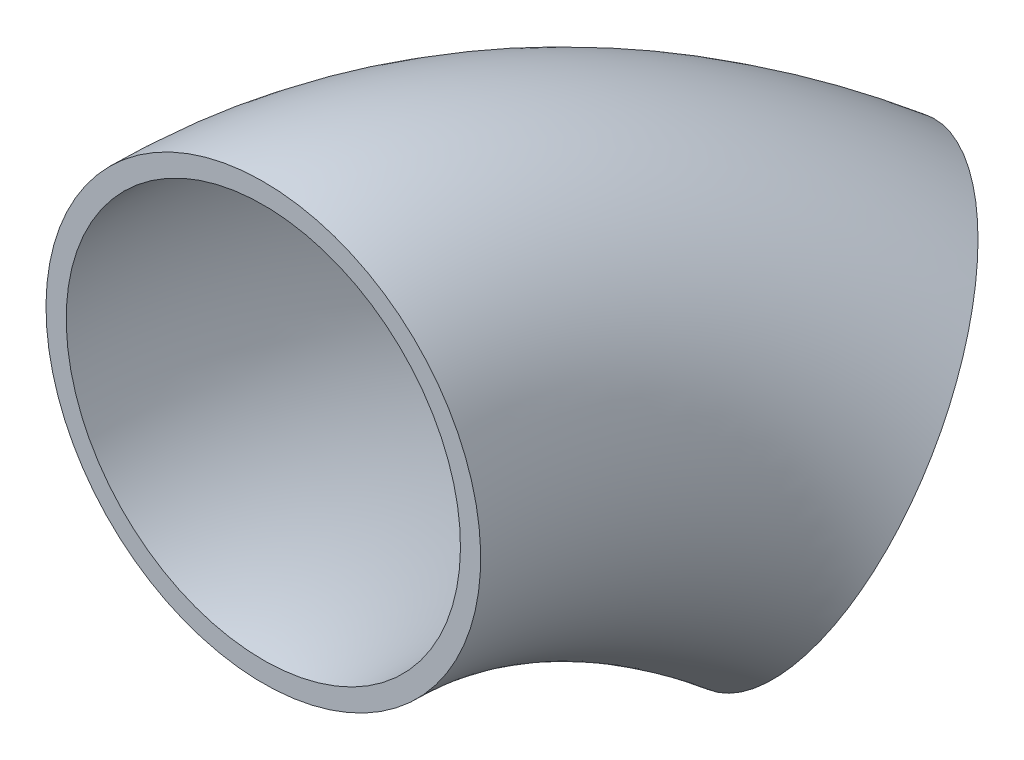
ISO-10303-21;
HEADER;
FILE_DESCRIPTION(('STEP AP214'),'2;1');
FILE_NAME('part.step','',(''),(''),'','','');
FILE_SCHEMA(('AUTOMOTIVE_DESIGN { 1 0 10303 214 1 1 1 1 }'));
ENDSEC;
DATA;
#1=APPLICATION_CONTEXT('core data for automotive mechanical design processes');
#2=APPLICATION_PROTOCOL_DEFINITION('international standard','automotive_design',2000,#1);
#3=PRODUCT_CONTEXT('',#1,'mechanical');
#4=PRODUCT('Part','Part','',(#3));
#5=PRODUCT_RELATED_PRODUCT_CATEGORY('part','',(#4));
#6=PRODUCT_DEFINITION_FORMATION('','',#4);
#7=PRODUCT_DEFINITION_CONTEXT('part definition',#1,'design');
#8=PRODUCT_DEFINITION('design','',#6,#7);
#9=PRODUCT_DEFINITION_SHAPE('','',#8);
#10=(LENGTH_UNIT() NAMED_UNIT(*) SI_UNIT(.MILLI.,.METRE.));
#11=(NAMED_UNIT(*) PLANE_ANGLE_UNIT() SI_UNIT($,.RADIAN.));
#12=(NAMED_UNIT(*) SI_UNIT($,.STERADIAN.) SOLID_ANGLE_UNIT());
#13=UNCERTAINTY_MEASURE_WITH_UNIT(LENGTH_MEASURE(1.E-05),#10,'distance_accuracy_value','');
#14=(GEOMETRIC_REPRESENTATION_CONTEXT(3) GLOBAL_UNCERTAINTY_ASSIGNED_CONTEXT((#13)) GLOBAL_UNIT_ASSIGNED_CONTEXT((#10,
#11,#12)) REPRESENTATION_CONTEXT('',''));
#15=CARTESIAN_POINT('',(0.,0.,0.));
#16=DIRECTION('',(0.,0.,1.));
#17=DIRECTION('',(1.,0.,0.));
#18=AXIS2_PLACEMENT_3D('',#15,#16,#17);
#19=CARTESIAN_POINT('',(269.407683632075,-269.407683632075,-1.77635683940025E-12));
#20=DIRECTION('',(0.707106781186548,0.707106781186547,0.));
#21=DIRECTION('',(-0.707106781186548,0.707106781186547,0.));
#22=AXIS2_PLACEMENT_3D('',#19,#20,#21);
#23=TOROIDAL_SURFACE('',#22,381.,123.825);
#24=CARTESIAN_POINT('',(78.9076836320746,-78.9076836320728,-269.407683632073));
#25=DIRECTION('',(-0.499999999999995,0.499999999999995,0.707106781186554));
#26=DIRECTION('',(0.853553390593277,0.146446609406723,0.499999999999995));
#27=AXIS2_PLACEMENT_3D('',#24,#25,#26);
#28=CIRCLE('',#27,123.825);
#29=CARTESIAN_POINT('',(16.9951836320735,-16.9951836320711,-356.965180812497));
#30=VERTEX_POINT('',#29);
#31=EDGE_CURVE('E32',#30,#30,#28,.T.);
#32=CARTESIAN_POINT('',(0.,0.,-3.5527136788005E-12));
#33=DIRECTION('',(0.,0.,1.));
#34=DIRECTION('',(1.,0.,0.));
#35=AXIS2_PLACEMENT_3D('',#32,#33,#34);
#36=CIRCLE('',#35,123.825);
#37=CARTESIAN_POINT('',(-87.5574971804242,87.5574971804242,-4.13002965160558E-12));
#38=VERTEX_POINT('',#37);
#39=EDGE_CURVE('E40',#38,#38,#36,.T.);
#40=CARTESIAN_POINT('',(269.407683632075,-269.407683632075,-1.77635683940025E-12));
#41=DIRECTION('',(0.707106781186548,0.707106781186547,0.));
#42=DIRECTION('',(-0.707106781186548,0.707106781186547,0.));
#43=AXIS2_PLACEMENT_3D('',#40,#41,#42);
#44=CIRCLE('',#43,504.825);
#45=EDGE_CURVE('',#30,#38,#44,.T.);
#46=ORIENTED_EDGE('',*,*,#31,.F.);
#47=ORIENTED_EDGE('',*,*,#39,.T.);
#48=ORIENTED_EDGE('',*,*,#45,.T.);
#49=ORIENTED_EDGE('',*,*,#45,.F.);
#50=EDGE_LOOP('',(#46,#48,#47,#49));
#51=FACE_BOUND('',#50,.T.);
#52=ADVANCED_FACE('F25',(#51),#23,.F.);
#53=CARTESIAN_POINT('',(269.407683632075,-269.407683632075,-1.77635683940025E-12));
#54=DIRECTION('',(0.707106781186548,0.707106781186547,0.));
#55=DIRECTION('',(-0.707106781186548,0.707106781186547,0.));
#56=AXIS2_PLACEMENT_3D('',#53,#54,#55);
#57=TOROIDAL_SURFACE('',#56,381.,136.525);
#58=CARTESIAN_POINT('',(78.9076836320746,-78.9076836320728,-269.407683632073));
#59=DIRECTION('',(-0.499999999999995,0.499999999999995,0.707106781186554));
#60=DIRECTION('',(0.853553390593277,0.146446609406723,0.499999999999995));
#61=AXIS2_PLACEMENT_3D('',#58,#59,#60);
#62=CIRCLE('',#61,136.525);
#63=CARTESIAN_POINT('',(10.6451836320735,-10.6451836320711,-365.945436933567));
#64=VERTEX_POINT('',#63);
#65=EDGE_CURVE('E10',#64,#64,#62,.T.);
#66=CARTESIAN_POINT('',(0.,0.,-3.5527136788005E-12));
#67=DIRECTION('',(0.,0.,1.));
#68=DIRECTION('',(1.,0.,0.));
#69=AXIS2_PLACEMENT_3D('',#66,#67,#68);
#70=CIRCLE('',#69,136.525);
#71=CARTESIAN_POINT('',(-96.5377533014934,96.5377533014934,-4.18924154625226E-12));
#72=VERTEX_POINT('',#71);
#73=EDGE_CURVE('E36',#72,#72,#70,.T.);
#74=CARTESIAN_POINT('',(269.407683632075,-269.407683632075,-1.77635683940025E-12));
#75=DIRECTION('',(0.707106781186548,0.707106781186547,0.));
#76=DIRECTION('',(-0.707106781186548,0.707106781186547,0.));
#77=AXIS2_PLACEMENT_3D('',#74,#75,#76);
#78=CIRCLE('',#77,517.525);
#79=EDGE_CURVE('',#64,#72,#78,.T.);
#80=ORIENTED_EDGE('',*,*,#65,.T.);
#81=ORIENTED_EDGE('',*,*,#73,.F.);
#82=ORIENTED_EDGE('',*,*,#79,.T.);
#83=ORIENTED_EDGE('',*,*,#79,.F.);
#84=EDGE_LOOP('',(#80,#82,#81,#83));
#85=FACE_BOUND('',#84,.T.);
#86=ADVANCED_FACE('F27',(#85),#57,.T.);
#87=CARTESIAN_POINT('',(78.9076836320746,-78.9076836320728,-269.407683632073));
#88=DIRECTION('',(-0.499999999999995,0.499999999999995,0.707106781186554));
#89=DIRECTION('',(0.853553390593277,0.146446609406723,0.499999999999995));
#90=AXIS2_PLACEMENT_3D('',#87,#88,#89);
#91=PLANE('',#90);
#92=ORIENTED_EDGE('',*,*,#31,.T.);
#93=EDGE_LOOP('',(#92));
#94=FACE_BOUND('',#93,.T.);
#95=ORIENTED_EDGE('',*,*,#65,.F.);
#96=EDGE_LOOP('',(#95));
#97=FACE_BOUND('',#96,.T.);
#98=ADVANCED_FACE('F50',(#94,#97),#91,.F.);
#99=CARTESIAN_POINT('',(0.,0.,-3.5527136788005E-12));
#100=DIRECTION('',(0.,0.,1.));
#101=DIRECTION('',(1.,0.,0.));
#102=AXIS2_PLACEMENT_3D('',#99,#100,#101);
#103=PLANE('',#102);
#104=ORIENTED_EDGE('',*,*,#39,.F.);
#105=EDGE_LOOP('',(#104));
#106=FACE_BOUND('',#105,.T.);
#107=ORIENTED_EDGE('',*,*,#73,.T.);
#108=EDGE_LOOP('',(#107));
#109=FACE_BOUND('',#108,.T.);
#110=ADVANCED_FACE('F47',(#106,#109),#103,.T.);
#111=CLOSED_SHELL('',(#52,#86,#98,#110));
#112=MANIFOLD_SOLID_BREP('B2',#111);
#113=ADVANCED_BREP_SHAPE_REPRESENTATION('',(#18,#112),#14);
#114=SHAPE_DEFINITION_REPRESENTATION(#9,#113);
ENDSEC;
END-ISO-10303-21;
